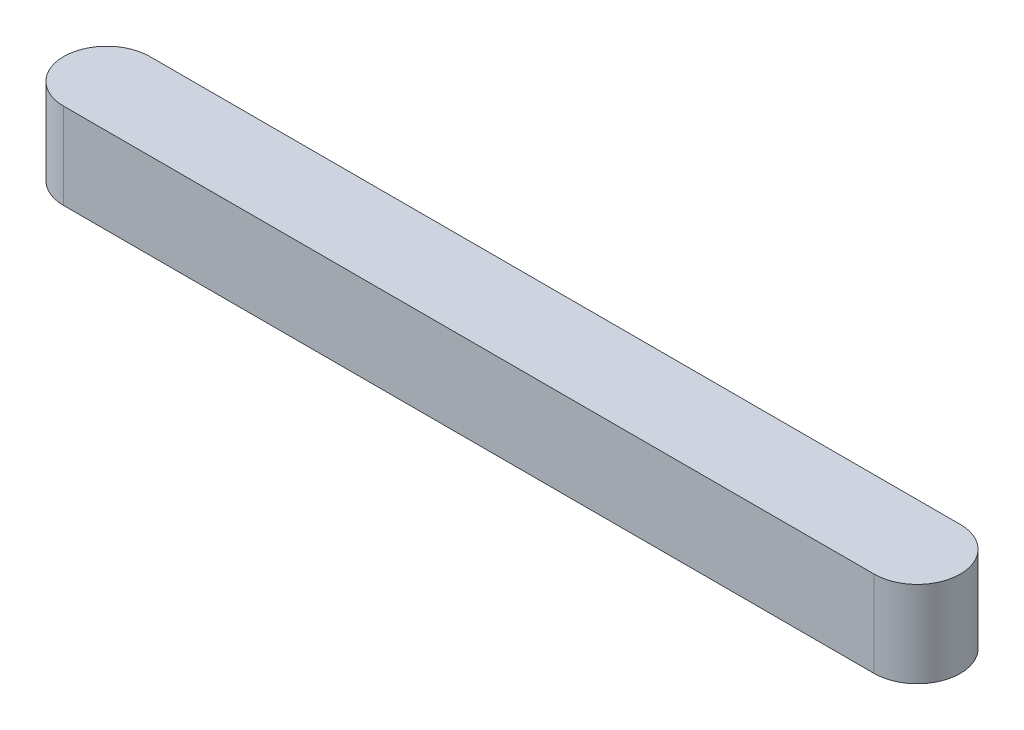
ISO-10303-21;
HEADER;
FILE_DESCRIPTION(('STEP AP214'),'2;1');
FILE_NAME('part.step','',(''),(''),'','','');
FILE_SCHEMA(('AUTOMOTIVE_DESIGN { 1 0 10303 214 1 1 1 1 }'));
ENDSEC;
DATA;
#1=APPLICATION_CONTEXT('core data for automotive mechanical design processes');
#2=APPLICATION_PROTOCOL_DEFINITION('international standard','automotive_design',2000,#1);
#3=PRODUCT_CONTEXT('',#1,'mechanical');
#4=PRODUCT('Part','Part','',(#3));
#5=PRODUCT_RELATED_PRODUCT_CATEGORY('part','',(#4));
#6=PRODUCT_DEFINITION_FORMATION('','',#4);
#7=PRODUCT_DEFINITION_CONTEXT('part definition',#1,'design');
#8=PRODUCT_DEFINITION('design','',#6,#7);
#9=PRODUCT_DEFINITION_SHAPE('','',#8);
#10=(LENGTH_UNIT() NAMED_UNIT(*) SI_UNIT(.MILLI.,.METRE.));
#11=(NAMED_UNIT(*) PLANE_ANGLE_UNIT() SI_UNIT($,.RADIAN.));
#12=(NAMED_UNIT(*) SI_UNIT($,.STERADIAN.) SOLID_ANGLE_UNIT());
#13=UNCERTAINTY_MEASURE_WITH_UNIT(LENGTH_MEASURE(1.E-05),#10,'distance_accuracy_value','');
#14=(GEOMETRIC_REPRESENTATION_CONTEXT(3) GLOBAL_UNCERTAINTY_ASSIGNED_CONTEXT((#13)) GLOBAL_UNIT_ASSIGNED_CONTEXT((#10,
#11,#12)) REPRESENTATION_CONTEXT('',''));
#15=CARTESIAN_POINT('',(0.,0.,0.));
#16=DIRECTION('',(0.,0.,1.));
#17=DIRECTION('',(1.,0.,0.));
#18=AXIS2_PLACEMENT_3D('',#15,#16,#17);
#19=CARTESIAN_POINT('',(-56.5,12.,0.));
#20=DIRECTION('',(0.,-1.,0.));
#21=DIRECTION('',(0.,0.,-1.));
#22=AXIS2_PLACEMENT_3D('',#19,#20,#21);
#23=CYLINDRICAL_SURFACE('',#22,6.00000000000002);
#24=CARTESIAN_POINT('',(-56.5,0.,0.));
#25=DIRECTION('',(0.,1.,0.));
#26=DIRECTION('',(0.,0.,1.));
#27=AXIS2_PLACEMENT_3D('',#24,#25,#26);
#28=CIRCLE('',#27,6.00000000000002);
#29=CARTESIAN_POINT('',(-56.5,0.,-6.00000000000002));
#30=VERTEX_POINT('',#29);
#31=CARTESIAN_POINT('',(-56.5,0.,6.00000000000002));
#32=VERTEX_POINT('',#31);
#33=EDGE_CURVE('E96',#30,#32,#28,.T.);
#34=ORIENTED_EDGE('',*,*,#33,.T.);
#35=DIRECTION('',(0.,-1.,0.));
#36=VECTOR('',#35,1.);
#37=CARTESIAN_POINT('',(-56.5,12.,6.00000000000002));
#38=LINE('',#37,#36);
#39=CARTESIAN_POINT('',(-56.5,12.,6.00000000000002));
#40=VERTEX_POINT('',#39);
#41=EDGE_CURVE('E11',#40,#32,#38,.T.);
#42=ORIENTED_EDGE('',*,*,#41,.F.);
#43=CARTESIAN_POINT('',(-56.5,12.,0.));
#44=DIRECTION('',(0.,1.,0.));
#45=DIRECTION('',(0.,0.,1.));
#46=AXIS2_PLACEMENT_3D('',#43,#44,#45);
#47=CIRCLE('',#46,6.00000000000002);
#48=CARTESIAN_POINT('',(-56.5,12.,-6.00000000000002));
#49=VERTEX_POINT('',#48);
#50=EDGE_CURVE('E84',#49,#40,#47,.T.);
#51=ORIENTED_EDGE('',*,*,#50,.F.);
#52=DIRECTION('',(0.,-1.,0.));
#53=VECTOR('',#52,1.);
#54=CARTESIAN_POINT('',(-56.5,12.,-6.00000000000002));
#55=LINE('',#54,#53);
#56=EDGE_CURVE('E92',#49,#30,#55,.T.);
#57=ORIENTED_EDGE('',*,*,#56,.T.);
#58=EDGE_LOOP('',(#34,#42,#51,#57));
#59=FACE_BOUND('',#58,.T.);
#60=ADVANCED_FACE('F33',(#59),#23,.T.);
#61=CARTESIAN_POINT('',(-56.5,12.,6.00000000000002));
#62=DIRECTION('',(0.,0.,-1.));
#63=DIRECTION('',(-1.,0.,0.));
#64=AXIS2_PLACEMENT_3D('',#61,#62,#63);
#65=PLANE('',#64);
#66=DIRECTION('',(1.,0.,0.));
#67=VECTOR('',#66,1.);
#68=CARTESIAN_POINT('',(-56.5,0.,6.00000000000002));
#69=LINE('',#68,#67);
#70=CARTESIAN_POINT('',(56.5,0.,6.));
#71=VERTEX_POINT('',#70);
#72=EDGE_CURVE('E88',#32,#71,#69,.T.);
#73=ORIENTED_EDGE('',*,*,#72,.T.);
#74=DIRECTION('',(0.,-1.,0.));
#75=VECTOR('',#74,1.);
#76=CARTESIAN_POINT('',(56.5,12.,6.));
#77=LINE('',#76,#75);
#78=CARTESIAN_POINT('',(56.5,12.,6.));
#79=VERTEX_POINT('',#78);
#80=EDGE_CURVE('E41',#79,#71,#77,.T.);
#81=ORIENTED_EDGE('',*,*,#80,.F.);
#82=DIRECTION('',(1.,0.,0.));
#83=VECTOR('',#82,1.);
#84=CARTESIAN_POINT('',(-56.5,12.,6.00000000000002));
#85=LINE('',#84,#83);
#86=EDGE_CURVE('E79',#40,#79,#85,.T.);
#87=ORIENTED_EDGE('',*,*,#86,.F.);
#88=ORIENTED_EDGE('',*,*,#41,.T.);
#89=EDGE_LOOP('',(#73,#81,#87,#88));
#90=FACE_BOUND('',#89,.T.);
#91=ADVANCED_FACE('F87',(#90),#65,.F.);
#92=CARTESIAN_POINT('',(56.5,12.,0.));
#93=DIRECTION('',(0.,-1.,0.));
#94=DIRECTION('',(0.,0.,-1.));
#95=AXIS2_PLACEMENT_3D('',#92,#93,#94);
#96=CYLINDRICAL_SURFACE('',#95,6.00000000000002);
#97=CARTESIAN_POINT('',(56.5,0.,0.));
#98=DIRECTION('',(0.,1.,0.));
#99=DIRECTION('',(0.,0.,1.));
#100=AXIS2_PLACEMENT_3D('',#97,#98,#99);
#101=CIRCLE('',#100,6.00000000000002);
#102=CARTESIAN_POINT('',(56.5,0.,-6.00000000000004));
#103=VERTEX_POINT('',#102);
#104=EDGE_CURVE('E66',#71,#103,#101,.T.);
#105=ORIENTED_EDGE('',*,*,#104,.T.);
#106=DIRECTION('',(0.,-1.,0.));
#107=VECTOR('',#106,1.);
#108=CARTESIAN_POINT('',(56.5,12.,-6.00000000000004));
#109=LINE('',#108,#107);
#110=CARTESIAN_POINT('',(56.5,12.,-6.00000000000004));
#111=VERTEX_POINT('',#110);
#112=EDGE_CURVE('E89',#111,#103,#109,.T.);
#113=ORIENTED_EDGE('',*,*,#112,.F.);
#114=CARTESIAN_POINT('',(56.5,12.,0.));
#115=DIRECTION('',(0.,1.,0.));
#116=DIRECTION('',(0.,0.,1.));
#117=AXIS2_PLACEMENT_3D('',#114,#115,#116);
#118=CIRCLE('',#117,6.00000000000002);
#119=EDGE_CURVE('E82',#79,#111,#118,.T.);
#120=ORIENTED_EDGE('',*,*,#119,.F.);
#121=ORIENTED_EDGE('',*,*,#80,.T.);
#122=EDGE_LOOP('',(#105,#113,#120,#121));
#123=FACE_BOUND('',#122,.T.);
#124=ADVANCED_FACE('F90',(#123),#96,.T.);
#125=CARTESIAN_POINT('',(-56.5,12.,-6.00000000000002));
#126=DIRECTION('',(0.,0.,1.));
#127=DIRECTION('',(1.,0.,0.));
#128=AXIS2_PLACEMENT_3D('',#125,#126,#127);
#129=PLANE('',#128);
#130=DIRECTION('',(-1.,0.,0.));
#131=VECTOR('',#130,1.);
#132=CARTESIAN_POINT('',(-56.5,0.,-6.00000000000002));
#133=LINE('',#132,#131);
#134=EDGE_CURVE('E72',#103,#30,#133,.T.);
#135=ORIENTED_EDGE('',*,*,#134,.T.);
#136=ORIENTED_EDGE('',*,*,#56,.F.);
#137=DIRECTION('',(-1.,0.,0.));
#138=VECTOR('',#137,1.);
#139=CARTESIAN_POINT('',(-56.5,12.,-6.00000000000002));
#140=LINE('',#139,#138);
#141=EDGE_CURVE('E49',#111,#49,#140,.T.);
#142=ORIENTED_EDGE('',*,*,#141,.F.);
#143=ORIENTED_EDGE('',*,*,#112,.T.);
#144=EDGE_LOOP('',(#135,#136,#142,#143));
#145=FACE_BOUND('',#144,.T.);
#146=ADVANCED_FACE('F103',(#145),#129,.F.);
#147=CARTESIAN_POINT('',(-56.5,12.,0.));
#148=DIRECTION('',(0.,1.,0.));
#149=DIRECTION('',(0.,0.,1.));
#150=AXIS2_PLACEMENT_3D('',#147,#148,#149);
#151=PLANE('',#150);
#152=ORIENTED_EDGE('',*,*,#50,.T.);
#153=ORIENTED_EDGE('',*,*,#86,.T.);
#154=ORIENTED_EDGE('',*,*,#119,.T.);
#155=ORIENTED_EDGE('',*,*,#141,.T.);
#156=EDGE_LOOP('',(#152,#153,#154,#155));
#157=FACE_BOUND('',#156,.T.);
#158=ADVANCED_FACE('F80',(#157),#151,.T.);
#159=CARTESIAN_POINT('',(-56.5,0.,0.));
#160=DIRECTION('',(0.,1.,0.));
#161=DIRECTION('',(0.,0.,1.));
#162=AXIS2_PLACEMENT_3D('',#159,#160,#161);
#163=PLANE('',#162);
#164=ORIENTED_EDGE('',*,*,#33,.F.);
#165=ORIENTED_EDGE('',*,*,#134,.F.);
#166=ORIENTED_EDGE('',*,*,#104,.F.);
#167=ORIENTED_EDGE('',*,*,#72,.F.);
#168=EDGE_LOOP('',(#164,#165,#166,#167));
#169=FACE_BOUND('',#168,.T.);
#170=ADVANCED_FACE('F106',(#169),#163,.F.);
#171=CLOSED_SHELL('',(#60,#91,#124,#146,#158,#170));
#172=MANIFOLD_SOLID_BREP('B2',#171);
#173=ADVANCED_BREP_SHAPE_REPRESENTATION('',(#18,#172),#14);
#174=SHAPE_DEFINITION_REPRESENTATION(#9,#173);
ENDSEC;
END-ISO-10303-21;
